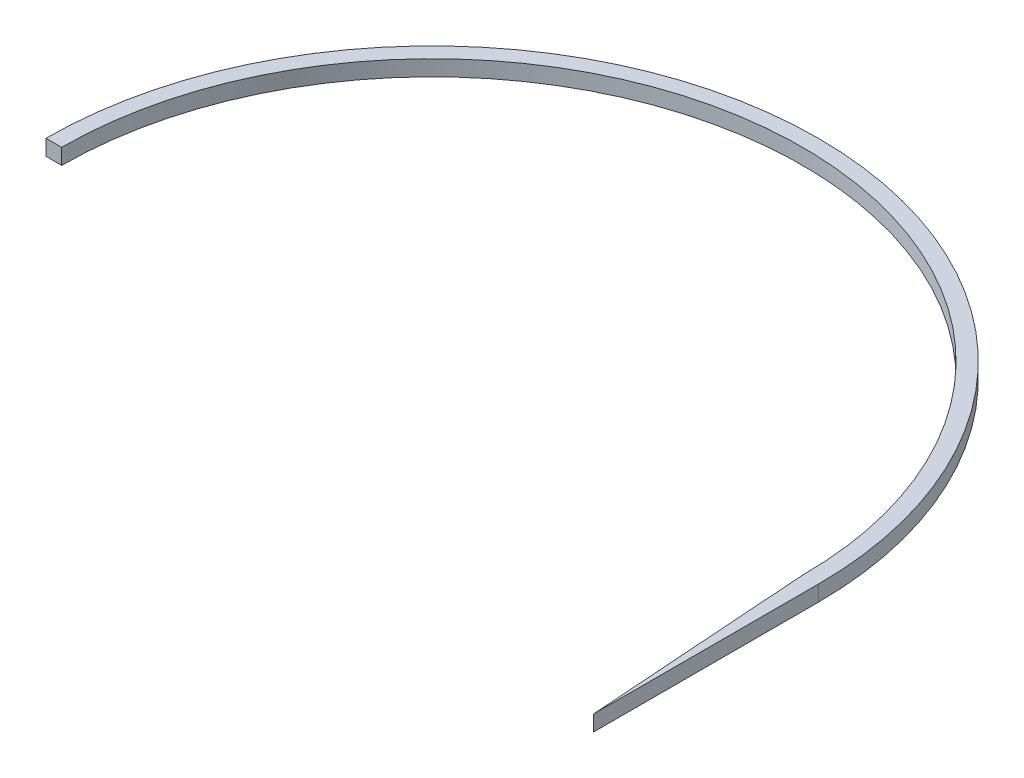
ISO-10303-21;
HEADER;
FILE_DESCRIPTION(('STEP AP214'),'2;1');
FILE_NAME('part.step','',(''),(''),'','','');
FILE_SCHEMA(('AUTOMOTIVE_DESIGN { 1 0 10303 214 1 1 1 1 }'));
ENDSEC;
DATA;
#1=APPLICATION_CONTEXT('core data for automotive mechanical design processes');
#2=APPLICATION_PROTOCOL_DEFINITION('international standard','automotive_design',2000,#1);
#3=PRODUCT_CONTEXT('',#1,'mechanical');
#4=PRODUCT('Part','Part','',(#3));
#5=PRODUCT_RELATED_PRODUCT_CATEGORY('part','',(#4));
#6=PRODUCT_DEFINITION_FORMATION('','',#4);
#7=PRODUCT_DEFINITION_CONTEXT('part definition',#1,'design');
#8=PRODUCT_DEFINITION('design','',#6,#7);
#9=PRODUCT_DEFINITION_SHAPE('','',#8);
#10=(LENGTH_UNIT() NAMED_UNIT(*) SI_UNIT(.MILLI.,.METRE.));
#11=(NAMED_UNIT(*) PLANE_ANGLE_UNIT() SI_UNIT($,.RADIAN.));
#12=(NAMED_UNIT(*) SI_UNIT($,.STERADIAN.) SOLID_ANGLE_UNIT());
#13=UNCERTAINTY_MEASURE_WITH_UNIT(LENGTH_MEASURE(1.E-05),#10,'distance_accuracy_value','');
#14=(GEOMETRIC_REPRESENTATION_CONTEXT(3) GLOBAL_UNCERTAINTY_ASSIGNED_CONTEXT((#13)) GLOBAL_UNIT_ASSIGNED_CONTEXT((#10,
#11,#12)) REPRESENTATION_CONTEXT('',''));
#15=CARTESIAN_POINT('',(0.,0.,0.));
#16=DIRECTION('',(0.,0.,1.));
#17=DIRECTION('',(1.,0.,0.));
#18=AXIS2_PLACEMENT_3D('',#15,#16,#17);
#19=CARTESIAN_POINT('',(-140.35,5.7,-115.));
#20=DIRECTION('',(0.,-1.,0.));
#21=DIRECTION('',(0.,0.,-1.));
#22=AXIS2_PLACEMENT_3D('',#19,#20,#21);
#23=CYLINDRICAL_SURFACE('',#22,134.65);
#24=CARTESIAN_POINT('',(-140.35,0.,-115.));
#25=DIRECTION('',(0.,-1.,0.));
#26=DIRECTION('',(0.,0.,1.));
#27=AXIS2_PLACEMENT_3D('',#24,#25,#26);
#28=CIRCLE('',#27,134.65);
#29=CARTESIAN_POINT('',(-275.,0.,-115.));
#30=VERTEX_POINT('',#29);
#31=CARTESIAN_POINT('',(-5.7,0.,-115.));
#32=VERTEX_POINT('',#31);
#33=EDGE_CURVE('E122',#30,#32,#28,.T.);
#34=ORIENTED_EDGE('',*,*,#33,.T.);
#35=DIRECTION('',(0.,-1.,0.));
#36=VECTOR('',#35,1.);
#37=CARTESIAN_POINT('',(-5.7,5.7,-115.));
#38=LINE('',#37,#36);
#39=CARTESIAN_POINT('',(-5.7,5.7,-115.));
#40=VERTEX_POINT('',#39);
#41=EDGE_CURVE('E11',#40,#32,#38,.T.);
#42=ORIENTED_EDGE('',*,*,#41,.F.);
#43=CARTESIAN_POINT('',(-140.35,5.7,-115.));
#44=DIRECTION('',(0.,-1.,0.));
#45=DIRECTION('',(0.,0.,1.));
#46=AXIS2_PLACEMENT_3D('',#43,#44,#45);
#47=CIRCLE('',#46,134.65);
#48=CARTESIAN_POINT('',(-275.,5.7,-115.));
#49=VERTEX_POINT('',#48);
#50=EDGE_CURVE('E135',#49,#40,#47,.T.);
#51=ORIENTED_EDGE('',*,*,#50,.F.);
#52=DIRECTION('',(0.,-1.,0.));
#53=VECTOR('',#52,1.);
#54=CARTESIAN_POINT('',(-275.,5.7,-115.));
#55=LINE('',#54,#53);
#56=EDGE_CURVE('E118',#49,#30,#55,.T.);
#57=ORIENTED_EDGE('',*,*,#56,.T.);
#58=EDGE_LOOP('',(#34,#42,#51,#57));
#59=FACE_BOUND('',#58,.T.);
#60=ADVANCED_FACE('F43',(#59),#23,.F.);
#61=CARTESIAN_POINT('',(0.,5.7,-33.3587708547817));
#62=DIRECTION('',(0.997571621079439,0.,-0.0696481214171656));
#63=DIRECTION('',(-0.0696481214171656,0.,-0.997571621079439));
#64=AXIS2_PLACEMENT_3D('',#61,#62,#63);
#65=PLANE('',#64);
#66=DIRECTION('',(0.0696481214171656,0.,0.997571621079439));
#67=VECTOR('',#66,1.);
#68=CARTESIAN_POINT('',(0.,0.,-33.3587708547817));
#69=LINE('',#68,#67);
#70=CARTESIAN_POINT('',(0.,0.,-33.3587708547817));
#71=VERTEX_POINT('',#70);
#72=EDGE_CURVE('E126',#32,#71,#69,.T.);
#73=ORIENTED_EDGE('',*,*,#72,.T.);
#74=DIRECTION('',(0.,-1.,0.));
#75=VECTOR('',#74,1.);
#76=CARTESIAN_POINT('',(0.,5.7,-33.3587708547817));
#77=LINE('',#76,#75);
#78=CARTESIAN_POINT('',(0.,5.7,-33.3587708547817));
#79=VERTEX_POINT('',#78);
#80=EDGE_CURVE('E52',#79,#71,#77,.T.);
#81=ORIENTED_EDGE('',*,*,#80,.F.);
#82=DIRECTION('',(0.0696481214171656,0.,0.997571621079439));
#83=VECTOR('',#82,1.);
#84=CARTESIAN_POINT('',(0.,5.7,-33.3587708547817));
#85=LINE('',#84,#83);
#86=EDGE_CURVE('E94',#40,#79,#85,.T.);
#87=ORIENTED_EDGE('',*,*,#86,.F.);
#88=ORIENTED_EDGE('',*,*,#41,.T.);
#89=EDGE_LOOP('',(#73,#81,#87,#88));
#90=FACE_BOUND('',#89,.T.);
#91=ADVANCED_FACE('F157',(#90),#65,.F.);
#92=CARTESIAN_POINT('',(0.,5.7,-115.));
#93=DIRECTION('',(-1.,0.,0.));
#94=DIRECTION('',(0.,0.,1.));
#95=AXIS2_PLACEMENT_3D('',#92,#93,#94);
#96=PLANE('',#95);
#97=DIRECTION('',(0.,0.,-1.));
#98=VECTOR('',#97,1.);
#99=CARTESIAN_POINT('',(0.,0.,-115.));
#100=LINE('',#99,#98);
#101=CARTESIAN_POINT('',(0.,0.,-115.));
#102=VERTEX_POINT('',#101);
#103=EDGE_CURVE('E110',#71,#102,#100,.T.);
#104=ORIENTED_EDGE('',*,*,#103,.T.);
#105=DIRECTION('',(0.,-1.,0.));
#106=VECTOR('',#105,1.);
#107=CARTESIAN_POINT('',(0.,5.7,-115.));
#108=LINE('',#107,#106);
#109=CARTESIAN_POINT('',(0.,5.7,-115.));
#110=VERTEX_POINT('',#109);
#111=EDGE_CURVE('E107',#110,#102,#108,.T.);
#112=ORIENTED_EDGE('',*,*,#111,.F.);
#113=DIRECTION('',(0.,0.,-1.));
#114=VECTOR('',#113,1.);
#115=CARTESIAN_POINT('',(0.,5.7,-115.));
#116=LINE('',#115,#114);
#117=EDGE_CURVE('E98',#79,#110,#116,.T.);
#118=ORIENTED_EDGE('',*,*,#117,.F.);
#119=ORIENTED_EDGE('',*,*,#80,.T.);
#120=EDGE_LOOP('',(#104,#112,#118,#119));
#121=FACE_BOUND('',#120,.T.);
#122=ADVANCED_FACE('F108',(#121),#96,.F.);
#123=CARTESIAN_POINT('',(-140.35,5.7,-115.));
#124=DIRECTION('',(0.,-1.,0.));
#125=DIRECTION('',(0.,0.,-1.));
#126=AXIS2_PLACEMENT_3D('',#123,#124,#125);
#127=CYLINDRICAL_SURFACE('',#126,140.35);
#128=CARTESIAN_POINT('',(-140.35,0.,-115.));
#129=DIRECTION('',(0.,1.,0.));
#130=DIRECTION('',(0.,0.,1.));
#131=AXIS2_PLACEMENT_3D('',#128,#129,#130);
#132=CIRCLE('',#131,140.35);
#133=CARTESIAN_POINT('',(-280.7,0.,-115.));
#134=VERTEX_POINT('',#133);
#135=EDGE_CURVE('E80',#102,#134,#132,.T.);
#136=ORIENTED_EDGE('',*,*,#135,.T.);
#137=DIRECTION('',(0.,-1.,0.));
#138=VECTOR('',#137,1.);
#139=CARTESIAN_POINT('',(-280.7,5.7,-115.));
#140=LINE('',#139,#138);
#141=CARTESIAN_POINT('',(-280.7,5.7,-115.));
#142=VERTEX_POINT('',#141);
#143=EDGE_CURVE('E112',#142,#134,#140,.T.);
#144=ORIENTED_EDGE('',*,*,#143,.F.);
#145=CARTESIAN_POINT('',(-140.35,5.7,-115.));
#146=DIRECTION('',(0.,1.,0.));
#147=DIRECTION('',(0.,0.,1.));
#148=AXIS2_PLACEMENT_3D('',#145,#146,#147);
#149=CIRCLE('',#148,140.35);
#150=EDGE_CURVE('E102',#110,#142,#149,.T.);
#151=ORIENTED_EDGE('',*,*,#150,.F.);
#152=ORIENTED_EDGE('',*,*,#111,.T.);
#153=EDGE_LOOP('',(#136,#144,#151,#152));
#154=FACE_BOUND('',#153,.T.);
#155=ADVANCED_FACE('F114',(#154),#127,.T.);
#156=CARTESIAN_POINT('',(-280.7,5.7,-115.));
#157=DIRECTION('',(0.,0.,-1.));
#158=DIRECTION('',(-1.,0.,0.));
#159=AXIS2_PLACEMENT_3D('',#156,#157,#158);
#160=PLANE('',#159);
#161=DIRECTION('',(1.,0.,0.));
#162=VECTOR('',#161,1.);
#163=CARTESIAN_POINT('',(-280.7,0.,-115.));
#164=LINE('',#163,#162);
#165=EDGE_CURVE('E86',#134,#30,#164,.T.);
#166=ORIENTED_EDGE('',*,*,#165,.T.);
#167=ORIENTED_EDGE('',*,*,#56,.F.);
#168=DIRECTION('',(1.,0.,0.));
#169=VECTOR('',#168,1.);
#170=CARTESIAN_POINT('',(-280.7,5.7,-115.));
#171=LINE('',#170,#169);
#172=EDGE_CURVE('E60',#142,#49,#171,.T.);
#173=ORIENTED_EDGE('',*,*,#172,.F.);
#174=ORIENTED_EDGE('',*,*,#143,.T.);
#175=EDGE_LOOP('',(#166,#167,#173,#174));
#176=FACE_BOUND('',#175,.T.);
#177=ADVANCED_FACE('F146',(#176),#160,.F.);
#178=CARTESIAN_POINT('',(-140.35,5.7,-115.));
#179=DIRECTION('',(0.,1.,0.));
#180=DIRECTION('',(0.,0.,1.));
#181=AXIS2_PLACEMENT_3D('',#178,#179,#180);
#182=PLANE('',#181);
#183=ORIENTED_EDGE('',*,*,#50,.T.);
#184=ORIENTED_EDGE('',*,*,#86,.T.);
#185=ORIENTED_EDGE('',*,*,#117,.T.);
#186=ORIENTED_EDGE('',*,*,#150,.T.);
#187=ORIENTED_EDGE('',*,*,#172,.T.);
#188=EDGE_LOOP('',(#183,#184,#185,#186,#187));
#189=FACE_BOUND('',#188,.T.);
#190=ADVANCED_FACE('F100',(#189),#182,.T.);
#191=CARTESIAN_POINT('',(-140.35,0.,-115.));
#192=DIRECTION('',(0.,1.,0.));
#193=DIRECTION('',(0.,0.,1.));
#194=AXIS2_PLACEMENT_3D('',#191,#192,#193);
#195=PLANE('',#194);
#196=ORIENTED_EDGE('',*,*,#33,.F.);
#197=ORIENTED_EDGE('',*,*,#165,.F.);
#198=ORIENTED_EDGE('',*,*,#135,.F.);
#199=ORIENTED_EDGE('',*,*,#103,.F.);
#200=ORIENTED_EDGE('',*,*,#72,.F.);
#201=EDGE_LOOP('',(#196,#197,#198,#199,#200));
#202=FACE_BOUND('',#201,.T.);
#203=ADVANCED_FACE('F142',(#202),#195,.F.);
#204=CLOSED_SHELL('',(#60,#91,#122,#155,#177,#190,#203));
#205=MANIFOLD_SOLID_BREP('B2',#204);
#206=ADVANCED_BREP_SHAPE_REPRESENTATION('',(#18,#205),#14);
#207=SHAPE_DEFINITION_REPRESENTATION(#9,#206);
ENDSEC;
END-ISO-10303-21;
